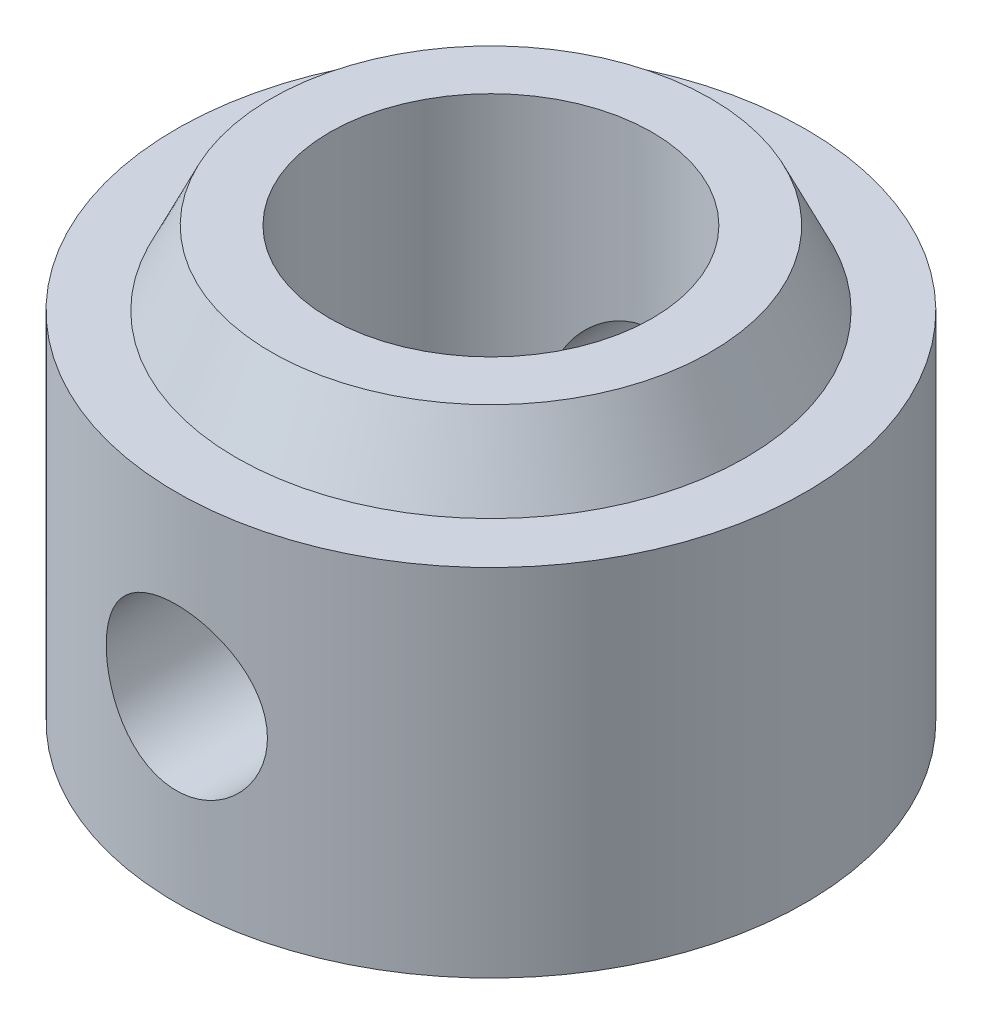
ISO-10303-21;
HEADER;
FILE_DESCRIPTION(('STEP AP214'),'2;1');
FILE_NAME('part.step','',(''),(''),'','','');
FILE_SCHEMA(('AUTOMOTIVE_DESIGN { 1 0 10303 214 1 1 1 1 }'));
ENDSEC;
DATA;
#1=APPLICATION_CONTEXT('core data for automotive mechanical design processes');
#2=APPLICATION_PROTOCOL_DEFINITION('international standard','automotive_design',2000,#1);
#3=PRODUCT_CONTEXT('',#1,'mechanical');
#4=PRODUCT('Part','Part','',(#3));
#5=PRODUCT_RELATED_PRODUCT_CATEGORY('part','',(#4));
#6=PRODUCT_DEFINITION_FORMATION('','',#4);
#7=PRODUCT_DEFINITION_CONTEXT('part definition',#1,'design');
#8=PRODUCT_DEFINITION('design','',#6,#7);
#9=PRODUCT_DEFINITION_SHAPE('','',#8);
#10=(LENGTH_UNIT() NAMED_UNIT(*) SI_UNIT(.MILLI.,.METRE.));
#11=(NAMED_UNIT(*) PLANE_ANGLE_UNIT() SI_UNIT($,.RADIAN.));
#12=(NAMED_UNIT(*) SI_UNIT($,.STERADIAN.) SOLID_ANGLE_UNIT());
#13=UNCERTAINTY_MEASURE_WITH_UNIT(LENGTH_MEASURE(1.E-05),#10,'distance_accuracy_value','');
#14=(GEOMETRIC_REPRESENTATION_CONTEXT(3) GLOBAL_UNCERTAINTY_ASSIGNED_CONTEXT((#13)) GLOBAL_UNIT_ASSIGNED_CONTEXT((#10,
#11,#12)) REPRESENTATION_CONTEXT('',''));
#15=CARTESIAN_POINT('',(0.,0.,0.));
#16=DIRECTION('',(0.,0.,1.));
#17=DIRECTION('',(1.,0.,0.));
#18=AXIS2_PLACEMENT_3D('',#15,#16,#17);
#19=CARTESIAN_POINT('',(2.794,5.461,0.));
#20=DIRECTION('',(0.,1.,0.));
#21=DIRECTION('',(0.,0.,1.));
#22=AXIS2_PLACEMENT_3D('',#19,#20,#21);
#23=PLANE('',#22);
#24=CARTESIAN_POINT('',(0.,5.461,0.));
#25=DIRECTION('',(0.,-1.,0.));
#26=DIRECTION('',(0.,0.,-1.));
#27=AXIS2_PLACEMENT_3D('',#24,#25,#26);
#28=CIRCLE('',#27,2.05);
#29=CARTESIAN_POINT('',(0.,5.461,-2.05));
#30=VERTEX_POINT('',#29);
#31=EDGE_CURVE('E51',#30,#30,#28,.T.);
#32=ORIENTED_EDGE('',*,*,#31,.T.);
#33=EDGE_LOOP('',(#32));
#34=FACE_BOUND('',#33,.T.);
#35=CARTESIAN_POINT('',(0.,5.461,0.));
#36=DIRECTION('',(0.,-1.,0.));
#37=DIRECTION('',(0.,0.,-1.));
#38=AXIS2_PLACEMENT_3D('',#35,#36,#37);
#39=CIRCLE('',#38,2.794);
#40=CARTESIAN_POINT('',(0.,5.461,-2.794));
#41=VERTEX_POINT('',#40);
#42=EDGE_CURVE('E110',#41,#41,#39,.T.);
#43=ORIENTED_EDGE('',*,*,#42,.F.);
#44=EDGE_LOOP('',(#43));
#45=FACE_BOUND('',#44,.T.);
#46=ADVANCED_FACE('F36',(#34,#45),#23,.T.);
#47=CARTESIAN_POINT('',(0.,0.,0.));
#48=DIRECTION('',(0.,-1.,0.));
#49=DIRECTION('',(0.,0.,-1.));
#50=AXIS2_PLACEMENT_3D('',#47,#48,#49);
#51=CYLINDRICAL_SURFACE('',#50,2.05);
#52=CARTESIAN_POINT('',(0.,3.28559999999999,-2.05));
#53=CARTESIAN_POINT('',(-0.0538862620268108,3.2855966151225,-2.04999706239255));
#54=CARTESIAN_POINT('',(-0.107836764690483,3.28132567505028,-2.04785253295006));
#55=CARTESIAN_POINT('',(-0.214143241150135,3.26443079765055,-2.03948509938331));
#56=CARTESIAN_POINT('',(-0.26649598888134,3.2517909971774,-2.03325445024708));
#57=CARTESIAN_POINT('',(-0.367906883502587,3.21877634616778,-2.01736686388394));
#58=CARTESIAN_POINT('',(-0.416976973012657,3.19843155614578,-2.00772325156958));
#59=CARTESIAN_POINT('',(-0.510934432226727,3.15074011310093,-1.98589420928673));
#60=CARTESIAN_POINT('',(-0.555822131339798,3.12339401214492,-1.97370897974368));
#61=CARTESIAN_POINT('',(-0.643195513205963,3.06059481927756,-1.94705164714508));
#62=CARTESIAN_POINT('',(-0.685371591400161,3.02475135877936,-1.93248579105724));
#63=CARTESIAN_POINT('',(-0.763398930988648,2.94681548377178,-1.90301469502913));
#64=CARTESIAN_POINT('',(-0.799245372684431,2.90471835193324,-1.88810920614261));
#65=CARTESIAN_POINT('',(-0.86638330046153,2.81155456673853,-1.85831424977281));
#66=CARTESIAN_POINT('',(-0.897105968940423,2.76004549919543,-1.84351566644385));
#67=CARTESIAN_POINT('',(-0.949322432562957,2.65177348061413,-1.81718128241629));
#68=CARTESIAN_POINT('',(-0.970822820340486,2.59501431805918,-1.80564315297165));
#69=CARTESIAN_POINT('',(-1.0025857532433,2.48131826694253,-1.78819313713754));
#70=CARTESIAN_POINT('',(-1.01344400350745,2.42459543663092,-1.78198578373307));
#71=CARTESIAN_POINT('',(-1.02543766814156,2.30982169127604,-1.77511437197241));
#72=CARTESIAN_POINT('',(-1.02658269058239,2.25177214560707,-1.77444483576871));
#73=CARTESIAN_POINT('',(-1.01955446935159,2.14345682507675,-1.7784870351368));
#74=CARTESIAN_POINT('',(-1.01247917352524,2.09309036799637,-1.78256482753564));
#75=CARTESIAN_POINT('',(-0.991113345283349,1.99438504289263,-1.79453134452197));
#76=CARTESIAN_POINT('',(-0.976820514495086,1.94604682606205,-1.80242128302571));
#77=CARTESIAN_POINT('',(-0.941165024895647,1.8513901391202,-1.8212966332306));
#78=CARTESIAN_POINT('',(-0.919645443793888,1.80514494124457,-1.83234986680599));
#79=CARTESIAN_POINT('',(-0.870267729859696,1.71669985009524,-1.85630989388439));
#80=CARTESIAN_POINT('',(-0.842406749907772,1.67450178600991,-1.86921751899696));
#81=CARTESIAN_POINT('',(-0.777017706285602,1.5897157159382,-1.89740986850868));
#82=CARTESIAN_POINT('',(-0.738711819828507,1.54775670458444,-1.91278847992665));
#83=CARTESIAN_POINT('',(-0.655544468209902,1.47059619594433,-1.94286313882918));
#84=CARTESIAN_POINT('',(-0.610679887988637,1.43539792816527,-1.95755885757771));
#85=CARTESIAN_POINT('',(-0.51302941847764,1.37122219744453,-1.98544536965038));
#86=CARTESIAN_POINT('',(-0.459972431389389,1.34260951574312,-1.99853458766058));
#87=CARTESIAN_POINT('',(-0.348977870876013,1.29495054523092,-2.02086828149273));
#88=CARTESIAN_POINT('',(-0.291044215671905,1.27589666035946,-2.03011580917141));
#89=CARTESIAN_POINT('',(-0.177085653952216,1.24946271119041,-2.04307442084972));
#90=CARTESIAN_POINT('',(-0.12130006881203,1.24124648335956,-2.04718061758844));
#91=CARTESIAN_POINT('',(-0.00899908994808621,1.23409865058715,-2.05074838795579));
#92=CARTESIAN_POINT('',(0.0475159453666497,1.23516264721954,-2.05021216189345));
#93=CARTESIAN_POINT('',(0.155013796285644,1.24606185562923,-2.04478472059777));
#94=CARTESIAN_POINT('',(0.206085893251203,1.25521084604829,-2.04023426830394));
#95=CARTESIAN_POINT('',(0.305867064609464,1.28094402369247,-2.02767725597689));
#96=CARTESIAN_POINT('',(0.354575877833271,1.2975290306147,-2.01967031492691));
#97=CARTESIAN_POINT('',(0.449860823660905,1.33809842809401,-2.00063857699011));
#98=CARTESIAN_POINT('',(0.496336156931306,1.36228082636974,-1.98953403814188));
#99=CARTESIAN_POINT('',(0.584722895741391,1.4171352240372,-1.96537573675037));
#100=CARTESIAN_POINT('',(0.626632345519661,1.44780998795827,-1.9523211445493));
#101=CARTESIAN_POINT('',(0.709061881522916,1.5182544359662,-1.92400926870901));
#102=CARTESIAN_POINT('',(0.749041379770251,1.55862144016491,-1.90866156969653));
#103=CARTESIAN_POINT('',(0.821902729141066,1.64552328005104,-1.87843951393971));
#104=CARTESIAN_POINT('',(0.854779670333107,1.69206234678679,-1.86356549066065));
#105=CARTESIAN_POINT('',(0.914000612360133,1.79283474555533,-1.8352747203172));
#106=CARTESIAN_POINT('',(0.939951133275598,1.84733154786382,-1.82196342905059));
#107=CARTESIAN_POINT('',(0.982034896664141,1.96079781938484,-1.7996342417733));
#108=CARTESIAN_POINT('',(0.998180788784752,2.01976141466372,-1.79061081696634));
#109=CARTESIAN_POINT('',(1.01870822963591,2.13443297843299,-1.77900538533884));
#110=CARTESIAN_POINT('',(1.02407032131088,2.18991010976476,-1.77588818047004));
#111=CARTESIAN_POINT('',(1.0257063832403,2.30103324385,-1.7749448851233));
#112=CARTESIAN_POINT('',(1.02198429279,2.35667916295792,-1.77711650118242));
#113=CARTESIAN_POINT('',(1.00647427873206,2.46097058907032,-1.78593808601276));
#114=CARTESIAN_POINT('',(0.995488522201361,2.50977798189801,-1.79214171844454));
#115=CARTESIAN_POINT('',(0.966754742180253,2.60480332241032,-1.80780291592616));
#116=CARTESIAN_POINT('',(0.949004543438797,2.65102043164427,-1.81726152758918));
#117=CARTESIAN_POINT('',(0.905911138933192,2.74299047226127,-1.83914243623642));
#118=CARTESIAN_POINT('',(0.880137916261861,2.78850359937544,-1.85172115456096));
#119=CARTESIAN_POINT('',(0.822204745927542,2.8748563995851,-1.87816214925455));
#120=CARTESIAN_POINT('',(0.790041475519606,2.91569362378145,-1.89202509139385));
#121=CARTESIAN_POINT('',(0.715658409831249,2.99669553191655,-1.92148881238296));
#122=CARTESIAN_POINT('',(0.672691533585417,3.03617557992097,-1.93709607894256));
#123=CARTESIAN_POINT('',(0.580308676375779,3.10751955800922,-1.96674696061465));
#124=CARTESIAN_POINT('',(0.530889241338197,3.13937938291194,-1.98078973073241));
#125=CARTESIAN_POINT('',(0.426329886740438,3.19461727183125,-2.00590459824731));
#126=CARTESIAN_POINT('',(0.371151991532973,3.21793377364672,-2.01695498976982));
#127=CARTESIAN_POINT('',(0.25701065382654,3.25465337211692,-2.03463874897552));
#128=CARTESIAN_POINT('',(0.198058494613739,3.26808464300031,-2.04128466457255));
#129=CARTESIAN_POINT('',(0.115416995145464,3.27934484635274,-2.04687848457405));
#130=CARTESIAN_POINT('',(0.0924159264254825,3.2816872068852,-2.04804599472682));
#131=CARTESIAN_POINT('',(0.0462805251023348,3.28481553215472,-2.04960739402311));
#132=CARTESIAN_POINT('',(0.023146188838565,3.28560145393297,-2.05000126181357));
#133=CARTESIAN_POINT('',(0.,3.28559999999999,-2.05));
#134=B_SPLINE_CURVE_WITH_KNOTS('',3,(#52,#53,#54,#55,#56,#57,#58,#59,#60,#61,#62,#63,#64,#65,
#66,#67,#68,#69,#70,#71,#72,#73,#74,#75,#76,#77,#78,#79,#80,#81,#82,#83,#84,#85,#86,#87,#88,#89,
#90,#91,#92,#93,#94,#95,#96,#97,#98,#99,#100,#101,#102,#103,#104,#105,#106,#107,#108,#109,#110,
#111,#112,#113,#114,#115,#116,#117,#118,#119,#120,#121,#122,#123,#124,#125,#126,#127,#128,#129,
#130,#131,#132,#133),.UNSPECIFIED.,.T.,.F.,(4,2,2,2,2,2,2,2,2,2,2,2,2,2,2,2,2,2,2,2,2,2,2,2,2,2,
2,2,2,2,2,2,2,2,2,2,2,2,2,2,4),(0.,0.161564863855799,0.323436853451926,0.484683709379603,
0.645917854596104,0.816906302686037,0.988024393595381,1.17241269591521,1.35666896595737,
1.52989462443734,1.70294891262245,1.85530855219552,2.00771674023819,2.16367496172698,
2.31970334291726,2.49551564867224,2.67141172963652,2.855475977698,3.03939372335085,
3.20807872733127,3.37668378624261,3.53222079168773,3.68777494671702,3.84777677428594,
4.00784687017045,4.18363600910527,4.35954628330815,4.54397549213663,4.72816624739294,
4.8946754018583,5.06111236356502,5.21169378500284,5.36232367003266,5.52307368195001,
5.68390750167428,5.86428373821307,6.04475692960983,6.22650614004494,6.40773531340549,
6.47713162141136,6.54652984477713),.UNSPECIFIED.);
#135=CARTESIAN_POINT('',(0.,3.28559999999999,-2.05));
#136=VERTEX_POINT('',#135);
#137=EDGE_CURVE('E82',#136,#136,#134,.T.);
#138=ORIENTED_EDGE('',*,*,#137,.F.);
#139=EDGE_LOOP('',(#138));
#140=FACE_BOUND('',#139,.T.);
#141=CARTESIAN_POINT('',(1.02499999999999,2.2606,1.7753520777581));
#142=CARTESIAN_POINT('',(1.02499627215139,2.20718949659987,1.77535673096671));
#143=CARTESIAN_POINT('',(1.02079747000154,2.15371155318683,1.77779896217451));
#144=CARTESIAN_POINT('',(1.0042162901455,2.04839705370592,1.78721425613354));
#145=CARTESIAN_POINT('',(0.991816716168026,1.99656418708051,1.79419683906949));
#146=CARTESIAN_POINT('',(0.9595024474173,1.89626204404746,1.81168080270534));
#147=CARTESIAN_POINT('',(0.939627701306067,1.84777648121458,1.82216344560084));
#148=CARTESIAN_POINT('',(0.893049213510774,1.75484019295337,1.8454373143728));
#149=CARTESIAN_POINT('',(0.866345102386661,1.71038968598098,1.85822866512967));
#150=CARTESIAN_POINT('',(0.804283204044144,1.62273662822856,1.88596790783878));
#151=CARTESIAN_POINT('',(0.768393337047358,1.57993938593462,1.90100665228903));
#152=CARTESIAN_POINT('',(0.690085152804824,1.50065640188313,1.93081282355349));
#153=CARTESIAN_POINT('',(0.647663598926844,1.4641738083519,1.94558011177031));
#154=CARTESIAN_POINT('',(0.554001802499904,1.39614867007365,1.97437013876773));
#155=CARTESIAN_POINT('',(0.502359868737884,1.36510488794399,1.98827559078627));
#156=CARTESIAN_POINT('',(0.393760952264487,1.3123306254231,2.01259525002017));
#157=CARTESIAN_POINT('',(0.336807351591605,1.29059426745941,2.02301165963335));
#158=CARTESIAN_POINT('',(0.223496067524124,1.25865772216638,2.03852472775343));
#159=CARTESIAN_POINT('',(0.167384335251035,1.24774673548559,2.04394717226414));
#160=CARTESIAN_POINT('',(0.0538848944152927,1.23542972835809,2.05007773442219));
#161=CARTESIAN_POINT('',(-0.00350202098983318,1.2340179567844,2.05078870454205));
#162=CARTESIAN_POINT('',(-0.112578337534344,1.24046534081962,2.04757056464361));
#163=CARTESIAN_POINT('',(-0.164329229156211,1.24752896590926,2.04403958289464));
#164=CARTESIAN_POINT('',(-0.26579661621628,1.26930286500228,2.03333601391241));
#165=CARTESIAN_POINT('',(-0.315512959121273,1.28401371120064,2.02616315418054));
#166=CARTESIAN_POINT('',(-0.412367126358791,1.32075963024207,2.00870872869846));
#167=CARTESIAN_POINT('',(-0.459459759103056,1.34289322100138,1.99838552567429));
#168=CARTESIAN_POINT('',(-0.54937622155116,1.39372000160654,1.97556087136354));
#169=CARTESIAN_POINT('',(-0.59219851505961,1.42241553988492,1.96305864061421));
#170=CARTESIAN_POINT('',(-0.676678002420647,1.48866773532135,1.9356550425921));
#171=CARTESIAN_POINT('',(-0.717842426905091,1.52680560403417,1.9206386039813));
#172=CARTESIAN_POINT('',(-0.793456979555221,1.60930446805344,1.89065699101482));
#173=CARTESIAN_POINT('',(-0.827901941863582,1.65367020658092,1.8756918647227));
#174=CARTESIAN_POINT('',(-0.891242968008262,1.75081439723469,1.84647759994797));
#175=CARTESIAN_POINT('',(-0.919647747852497,1.80394817363057,1.83233427990476));
#176=CARTESIAN_POINT('',(-0.966902090826257,1.91511111314298,1.80784836535541));
#177=CARTESIAN_POINT('',(-0.985761624666156,1.973135093843,1.79750180797219));
#178=CARTESIAN_POINT('',(-1.01185971630066,2.08759487406486,1.78293251712461));
#179=CARTESIAN_POINT('',(-1.01990075017297,2.14379214701964,1.77828947244709));
#180=CARTESIAN_POINT('',(-1.02655487027671,2.25691137505446,1.7744586734565));
#181=CARTESIAN_POINT('',(-1.02517461624789,2.31383278984778,1.77526706561545));
#182=CARTESIAN_POINT('',(-1.01376194442756,2.4201452665432,1.781801949541));
#183=CARTESIAN_POINT('',(-1.00469251213027,2.46967893738563,1.78698077194321));
#184=CARTESIAN_POINT('',(-0.979588691748245,2.56642698092773,1.80086372090125));
#185=CARTESIAN_POINT('',(-0.963552048089197,2.61364059701527,1.8095689890516));
#186=CARTESIAN_POINT('',(-0.924188778320001,2.70689661417526,1.82999627631648));
#187=CARTESIAN_POINT('',(-0.900558915285034,2.75278349227489,1.8418393432414));
#188=CARTESIAN_POINT('',(-0.846944240616192,2.84020600332747,1.86710022484681));
#189=CARTESIAN_POINT('',(-0.816956164440514,2.88173938460111,1.88051884689027));
#190=CARTESIAN_POINT('',(-0.747058096378818,2.96475323671163,1.90945198417745));
#191=CARTESIAN_POINT('',(-0.706373904122834,3.0055670794856,1.92501747733147));
#192=CARTESIAN_POINT('',(-0.618489607783239,3.07999754394343,1.9550259085234));
#193=CARTESIAN_POINT('',(-0.571287311521724,3.1136117344863,1.96946846632902));
#194=CARTESIAN_POINT('',(-0.46999874662272,3.17343806909885,1.99609895733231));
#195=CARTESIAN_POINT('',(-0.41576367501346,3.19943144616618,2.0082173271383));
#196=CARTESIAN_POINT('',(-0.302910423757104,3.24166635145382,2.02830438833284));
#197=CARTESIAN_POINT('',(-0.244296143926976,3.25791644265046,2.03627672268282));
#198=CARTESIAN_POINT('',(-0.130154174388674,3.27880277827902,2.0465919588643));
#199=CARTESIAN_POINT('',(-0.0748367299467154,3.28436782277301,2.04938426105896));
#200=CARTESIAN_POINT('',(0.0360041355999858,3.28646434709075,2.05043183634509));
#201=CARTESIAN_POINT('',(0.0915274778024655,3.28299898923665,2.04868869768562));
#202=CARTESIAN_POINT('',(0.197351442125077,3.26774818303448,2.04112318058871));
#203=CARTESIAN_POINT('',(0.247755125756546,3.25652602951088,2.0355771703469));
#204=CARTESIAN_POINT('',(0.345882100988208,3.22683982571445,2.02121896005009));
#205=CARTESIAN_POINT('',(0.393605007079396,3.2083747369042,2.01240629161116));
#206=CARTESIAN_POINT('',(0.487308991401006,3.16390477152987,1.99184079016823));
#207=CARTESIAN_POINT('',(0.533128271267546,3.13761119371196,1.97997832628769));
#208=CARTESIAN_POINT('',(0.619894007859373,3.07859312086947,1.95455336470372));
#209=CARTESIAN_POINT('',(0.660838212600278,3.04586567215643,1.9409900872232));
#210=CARTESIAN_POINT('',(0.740986854260811,2.97113293250172,1.91191825482293));
#211=CARTESIAN_POINT('',(0.77961262665275,2.92852845033587,1.8963504398699));
#212=CARTESIAN_POINT('',(0.849379869579538,2.83721301084198,1.86614653066924));
#213=CARTESIAN_POINT('',(0.880514718760306,2.78849670861062,1.85151126905912));
#214=CARTESIAN_POINT('',(0.935241856780291,2.68429743725451,1.82449595437539));
#215=CARTESIAN_POINT('',(0.958564692609957,2.62864928059304,1.81220178612677));
#216=CARTESIAN_POINT('',(0.995150677244065,2.51343428555172,1.79237810236561));
#217=CARTESIAN_POINT('',(1.00844747095472,2.45388128886449,1.78483266551395));
#218=CARTESIAN_POINT('',(1.01922618306102,2.3714995104567,1.77867504416836));
#219=CARTESIAN_POINT('',(1.02138800758794,2.34939790824217,1.77743332230281));
#220=CARTESIAN_POINT('',(1.0242757402172,2.3050681073007,1.77577084284944));
#221=CARTESIAN_POINT('',(1.02500155225986,2.28283990020448,1.77535014018238));
#222=CARTESIAN_POINT('',(1.02499999999999,2.2606,1.7753520777581));
#223=B_SPLINE_CURVE_WITH_KNOTS('',3,(#141,#142,#143,#144,#145,#146,#147,#148,#149,#150,#151,
#152,#153,#154,#155,#156,#157,#158,#159,#160,#161,#162,#163,#164,#165,#166,#167,#168,#169,#170,
#171,#172,#173,#174,#175,#176,#177,#178,#179,#180,#181,#182,#183,#184,#185,#186,#187,#188,#189,
#190,#191,#192,#193,#194,#195,#196,#197,#198,#199,#200,#201,#202,#203,#204,#205,#206,#207,#208,
#209,#210,#211,#212,#213,#214,#215,#216,#217,#218,#219,#220,#221,#222),.UNSPECIFIED.,.T.,.F.,(4,
2,2,2,2,2,2,2,2,2,2,2,2,2,2,2,2,2,2,2,2,2,2,2,2,2,2,2,2,2,2,2,2,2,2,2,2,2,2,2,4),(0.,
0.160137925659582,0.320612715145423,0.480241810816855,0.639879543581275,0.812683870310685,
0.985574103614796,1.17011839544732,1.35454597637987,1.52585072092133,1.6970517427819,
1.85336499921651,2.0096899533039,2.16817773099424,2.32672231834027,2.50025371243311,
2.67391799452065,2.85861062772683,3.04310993566995,3.21298848125565,3.3827469551808,
3.53393538009624,3.68517278746962,3.84341478816237,4.00173823375546,4.18001912170126,
4.35836011602654,4.54140785948287,4.72429449303988,4.89040077149221,5.05644888963817,
5.21155535493276,5.3666840684981,5.52844769487455,5.69028575853233,5.86822997896315,
6.04633091416279,6.23006017764566,6.41317011327825,6.47984638564938,6.54652711806899),.UNSPECIFIED.);
#224=CARTESIAN_POINT('',(1.02499999999999,2.2606,1.7753520777581));
#225=VERTEX_POINT('',#224);
#226=EDGE_CURVE('E77',#225,#225,#223,.T.);
#227=ORIENTED_EDGE('',*,*,#226,.F.);
#228=EDGE_LOOP('',(#227));
#229=FACE_BOUND('',#228,.T.);
#230=CARTESIAN_POINT('',(0.,0.,0.));
#231=DIRECTION('',(0.,-1.,0.));
#232=DIRECTION('',(0.,0.,-1.));
#233=AXIS2_PLACEMENT_3D('',#230,#231,#232);
#234=CIRCLE('',#233,2.05);
#235=CARTESIAN_POINT('',(0.,0.,-2.05));
#236=VERTEX_POINT('',#235);
#237=EDGE_CURVE('E55',#236,#236,#234,.T.);
#238=ORIENTED_EDGE('',*,*,#237,.T.);
#239=EDGE_LOOP('',(#238));
#240=FACE_BOUND('',#239,.T.);
#241=ORIENTED_EDGE('',*,*,#31,.F.);
#242=EDGE_LOOP('',(#241));
#243=FACE_BOUND('',#242,.T.);
#244=ADVANCED_FACE('F87',(#140,#229,#240,#243),#51,.F.);
#245=CARTESIAN_POINT('',(2.05,0.,0.));
#246=DIRECTION('',(0.,-1.,0.));
#247=DIRECTION('',(0.,0.,-1.));
#248=AXIS2_PLACEMENT_3D('',#245,#246,#247);
#249=PLANE('',#248);
#250=CARTESIAN_POINT('',(0.,0.,0.));
#251=DIRECTION('',(0.,-1.,0.));
#252=DIRECTION('',(0.,0.,-1.));
#253=AXIS2_PLACEMENT_3D('',#250,#251,#252);
#254=CIRCLE('',#253,4.0005);
#255=CARTESIAN_POINT('',(0.,0.,-4.0005));
#256=VERTEX_POINT('',#255);
#257=EDGE_CURVE('E120',#256,#256,#254,.T.);
#258=ORIENTED_EDGE('',*,*,#257,.T.);
#259=EDGE_LOOP('',(#258));
#260=FACE_BOUND('',#259,.T.);
#261=ORIENTED_EDGE('',*,*,#237,.F.);
#262=EDGE_LOOP('',(#261));
#263=FACE_BOUND('',#262,.T.);
#264=ADVANCED_FACE('F90',(#260,#263),#249,.T.);
#265=CARTESIAN_POINT('',(0.,0.,0.));
#266=DIRECTION('',(0.,-1.,0.));
#267=DIRECTION('',(0.,0.,-1.));
#268=AXIS2_PLACEMENT_3D('',#265,#266,#267);
#269=CYLINDRICAL_SURFACE('',#268,4.0005);
#270=CARTESIAN_POINT('',(0.,3.28559999999999,-4.0005));
#271=CARTESIAN_POINT('',(0.0565856520355311,3.28559849777205,-4.00049907665074));
#272=CARTESIAN_POINT('',(0.113187824681379,3.28089849548102,-3.99928751601397));
#273=CARTESIAN_POINT('',(0.224766894228792,3.26225269364964,-3.99457185317012));
#274=CARTESIAN_POINT('',(0.27974290452061,3.24830194409511,-3.99106652359556));
#275=CARTESIAN_POINT('',(0.38644249190922,3.21163399004599,-3.98215102125961));
#276=CARTESIAN_POINT('',(0.438169989596085,3.18892759863071,-3.97674319876614));
#277=CARTESIAN_POINT('',(0.537082037222003,3.13543170778277,-3.96459702091124));
#278=CARTESIAN_POINT('',(0.584266378294337,3.10464183696316,-3.95785860442061));
#279=CARTESIAN_POINT('',(0.673769466813125,3.03515230170528,-3.94361895772714));
#280=CARTESIAN_POINT('',(0.715976368500867,2.99631108142151,-3.93610548786994));
#281=CARTESIAN_POINT('',(0.793353940988788,2.91212430487071,-3.92124285736807));
#282=CARTESIAN_POINT('',(0.828523777728434,2.86677797868534,-3.91389371629186));
#283=CARTESIAN_POINT('',(0.891361949953948,2.76999087243635,-3.9000677913987));
#284=CARTESIAN_POINT('',(0.918903871040848,2.71846560215945,-3.89360651146785));
#285=CARTESIAN_POINT('',(0.964890978467045,2.61132388915671,-3.88246691727216));
#286=CARTESIAN_POINT('',(0.983337700029715,2.55570813870561,-3.87778830213288));
#287=CARTESIAN_POINT('',(1.01022669536665,2.44319732502387,-3.87086977569368));
#288=CARTESIAN_POINT('',(1.01887069272048,2.38635356197169,-3.86858077192817));
#289=CARTESIAN_POINT('',(1.02653741731668,2.27198018220795,-3.86655378933475));
#290=CARTESIAN_POINT('',(1.02556179410691,2.21445068477419,-3.86681537313852));
#291=CARTESIAN_POINT('',(1.01417762540951,2.10189526053198,-3.86981595078273));
#292=CARTESIAN_POINT('',(1.00401080428216,2.04684292640748,-3.87249145599117));
#293=CARTESIAN_POINT('',(0.97491900866929,1.93925260200016,-3.87991706018316));
#294=CARTESIAN_POINT('',(0.95599338232822,1.88671479917718,-3.88466731357399));
#295=CARTESIAN_POINT('',(0.909718532370253,1.78500335565479,-3.89576455424812));
#296=CARTESIAN_POINT('',(0.882282677942408,1.73587098107854,-3.90212783380235));
#297=CARTESIAN_POINT('',(0.819826705209562,1.64282140484394,-3.9157251097992));
#298=CARTESIAN_POINT('',(0.784805198572286,1.59890516012708,-3.92295926552248));
#299=CARTESIAN_POINT('',(0.706925856302228,1.51615073489325,-3.93774939369166));
#300=CARTESIAN_POINT('',(0.663864395745712,1.47750449410637,-3.9453085088336));
#301=CARTESIAN_POINT('',(0.571780475697047,1.40794437822194,-3.9597014691485));
#302=CARTESIAN_POINT('',(0.522757815690972,1.37703076332991,-3.96653528991061));
#303=CARTESIAN_POINT('',(0.419860664920584,1.32373784814417,-3.97874452966118));
#304=CARTESIAN_POINT('',(0.365968649407784,1.30139102489297,-3.984114376888));
#305=CARTESIAN_POINT('',(0.255024321130355,1.26612841493599,-3.992750215979));
#306=CARTESIAN_POINT('',(0.19797264675609,1.25321073055341,-3.99601663115725));
#307=CARTESIAN_POINT('',(0.0839684367910663,1.23746922637122,-4.00001442218531));
#308=CARTESIAN_POINT('',(0.0270542170308757,1.23438418185035,-4.00081138779299));
#309=CARTESIAN_POINT('',(-0.0864776689434303,1.23767725439246,-3.99996794009198));
#310=CARTESIAN_POINT('',(-0.143095362779339,1.24405447371293,-3.99832775801029));
#311=CARTESIAN_POINT('',(-0.253510277163968,1.26587609532791,-3.99283646479678));
#312=CARTESIAN_POINT('',(-0.307337795550936,1.2811768185167,-3.98902040909669));
#313=CARTESIAN_POINT('',(-0.411658439333348,1.32024600315928,-3.97960841995657));
#314=CARTESIAN_POINT('',(-0.4621512178361,1.34401534391239,-3.97401230169854));
#315=CARTESIAN_POINT('',(-0.559399526306897,1.39984531483197,-3.96150507079384));
#316=CARTESIAN_POINT('',(-0.606068998524409,1.43205071910153,-3.95457161773689));
#317=CARTESIAN_POINT('',(-0.693433574592071,1.50365470100679,-3.94019209400238));
#318=CARTESIAN_POINT('',(-0.734127590301489,1.54305458584604,-3.93274593032109));
#319=CARTESIAN_POINT('',(-0.809471560504464,1.62914439189758,-3.91794217807143));
#320=CARTESIAN_POINT('',(-0.843937860780835,1.67599657610982,-3.91059186780342));
#321=CARTESIAN_POINT('',(-0.904520337582659,1.77497264100638,-3.89702588219254));
#322=CARTESIAN_POINT('',(-0.930636879119626,1.82709629111627,-3.89081015725614));
#323=CARTESIAN_POINT('',(-0.973582573928539,1.93486171479209,-3.88028688582065));
#324=CARTESIAN_POINT('',(-0.990466536916038,1.99048049135351,-3.87596810879017));
#325=CARTESIAN_POINT('',(-1.01460737787969,2.10389566089835,-3.86971969862209));
#326=CARTESIAN_POINT('',(-1.02186648899609,2.16169154555165,-3.86778951129527));
#327=CARTESIAN_POINT('',(-1.02643050385148,2.27594737493201,-3.86658056547745));
#328=CARTESIAN_POINT('',(-1.0240295255589,2.3323949253605,-3.86722346187657));
#329=CARTESIAN_POINT('',(-1.01001799086857,2.44405142804303,-3.87090626775807));
#330=CARTESIAN_POINT('',(-0.998407637939617,2.49926040763393,-3.87394612428282));
#331=CARTESIAN_POINT('',(-0.96647125753609,2.6065343658981,-3.88203556582922));
#332=CARTESIAN_POINT('',(-0.946203018290877,2.65861762440886,-3.88707180992111));
#333=CARTESIAN_POINT('',(-0.897571546702513,2.75868245583385,-3.89858785099527));
#334=CARTESIAN_POINT('',(-0.86920713640441,2.80666343056391,-3.90506785800816));
#335=CARTESIAN_POINT('',(-0.804277673936519,2.89857663791603,-3.91896244761567));
#336=CARTESIAN_POINT('',(-0.767509768144362,2.94236246401581,-3.92639772474921));
#337=CARTESIAN_POINT('',(-0.687208852605598,3.02323835803092,-3.9412445353546));
#338=CARTESIAN_POINT('',(-0.643674225670723,3.06032682074139,-3.94865606271717));
#339=CARTESIAN_POINT('',(-0.55006222236862,3.12745485883959,-3.96279102374742));
#340=CARTESIAN_POINT('',(-0.499874845350383,3.15734467711237,-3.96949842814516));
#341=CARTESIAN_POINT('',(-0.395019205586422,3.20821554889441,-3.98129811383972));
#342=CARTESIAN_POINT('',(-0.34035406329836,3.22920274448214,-3.98639150805527));
#343=CARTESIAN_POINT('',(-0.238186536461553,3.25869473890942,-3.99367058697017));
#344=CARTESIAN_POINT('',(-0.191154498557696,3.26876181802624,-3.99621363758003));
#345=CARTESIAN_POINT('',(-0.0960855549946674,3.28221480803541,-3.99962866650269));
#346=CARTESIAN_POINT('',(-0.0480487333964109,3.28560127559102,-4.00050078404615));
#347=CARTESIAN_POINT('',(0.,3.28559999999999,-4.0005));
#348=B_SPLINE_CURVE_WITH_KNOTS('',3,(#270,#271,#272,#273,#274,#275,#276,#277,#278,#279,#280,
#281,#282,#283,#284,#285,#286,#287,#288,#289,#290,#291,#292,#293,#294,#295,#296,#297,#298,#299,
#300,#301,#302,#303,#304,#305,#306,#307,#308,#309,#310,#311,#312,#313,#314,#315,#316,#317,#318,
#319,#320,#321,#322,#323,#324,#325,#326,#327,#328,#329,#330,#331,#332,#333,#334,#335,#336,#337,
#338,#339,#340,#341,#342,#343,#344,#345,#346,#347),.UNSPECIFIED.,.T.,.F.,(4,2,2,2,2,2,2,2,2,2,2,
2,2,2,2,2,2,2,2,2,2,2,2,2,2,2,2,2,2,2,2,2,2,2,2,2,2,2,4),(0.,0.169580829374382,
0.339252473641572,0.50871524376946,0.678185801048968,0.850936364322594,1.02370739055761,
1.19919035607852,1.3746436908191,1.54641696915123,1.71816079275437,1.88551517966282,
2.05288202357081,2.22201184145331,2.39117263980846,2.56540986708087,2.73965295670698,
2.91455022594671,3.08941228623732,3.25958828234983,3.42974813386286,3.59724102176596,
3.76475130558077,3.9353496906081,4.10597910346527,4.28102394710351,4.45606113757183,
4.63004760592823,4.80399369919943,4.9726843993393,5.1413713725877,5.30894959521507,
5.47655221212774,5.64873329866688,5.82095559845911,5.99649972742941,6.17192254760959,
6.31593119286833,6.45992783807153),.UNSPECIFIED.);
#349=CARTESIAN_POINT('',(0.,3.28559999999999,-4.0005));
#350=VERTEX_POINT('',#349);
#351=EDGE_CURVE('E10',#350,#350,#348,.T.);
#352=ORIENTED_EDGE('',*,*,#351,.F.);
#353=EDGE_LOOP('',(#352));
#354=FACE_BOUND('',#353,.T.);
#355=CARTESIAN_POINT('',(1.02499999999999,2.2606,3.86695943216373));
#356=CARTESIAN_POINT('',(1.02499847839395,2.31715127083633,3.86696048112815));
#357=CARTESIAN_POINT('',(1.02030398935772,2.37371910198535,3.86821351283285));
#358=CARTESIAN_POINT('',(1.00168206772039,2.48522693941926,3.87307665172426));
#359=CARTESIAN_POINT('',(0.987749534848884,2.54016602897127,3.87668806094086));
#360=CARTESIAN_POINT('',(0.951134812067311,2.64678729969593,3.88583269568403));
#361=CARTESIAN_POINT('',(0.92846428458393,2.6984737156361,3.89136335864456));
#362=CARTESIAN_POINT('',(0.875053008903884,2.7973161325729,3.90372011571529));
#363=CARTESIAN_POINT('',(0.844311812846381,2.84447188195351,3.91054628171023));
#364=CARTESIAN_POINT('',(0.774872858088816,2.9340038861901,3.92490152942573));
#365=CARTESIAN_POINT('',(0.736022582149426,2.97626000226275,3.93244229862389));
#366=CARTESIAN_POINT('',(0.651796614338291,3.05373351506768,3.94727589925247));
#367=CARTESIAN_POINT('',(0.606420289369123,3.08895022810859,3.95456870654295));
#368=CARTESIAN_POINT('',(0.509603578634907,3.15184024855808,3.96821439809951));
#369=CARTESIAN_POINT('',(0.458083832980048,3.17939501517956,3.97455188384275));
#370=CARTESIAN_POINT('',(0.350953933207238,3.22540735616127,3.98543925277415));
#371=CARTESIAN_POINT('',(0.295344415547337,3.24386634259569,3.98998941341329));
#372=CARTESIAN_POINT('',(0.182866555410419,3.27077686151273,3.99670682295692));
#373=CARTESIAN_POINT('',(0.126050004224203,3.27943253894234,3.99892261178148));
#374=CARTESIAN_POINT('',(0.011730935680085,3.28713207719075,4.00089097437555));
#375=CARTESIAN_POINT('',(-0.0457714739784088,3.28617742776476,4.00064392992388));
#376=CARTESIAN_POINT('',(-0.158412262668894,3.27482911508599,3.99775038638296));
#377=CARTESIAN_POINT('',(-0.213574506732198,3.26465588106133,3.99515992411245));
#378=CARTESIAN_POINT('',(-0.321381204386072,3.23551415085209,3.98793617876054));
#379=CARTESIAN_POINT('',(-0.374025520102875,3.21654517364737,3.98330278395627));
#380=CARTESIAN_POINT('',(-0.475876108972816,3.17017553196384,3.97242901760515));
#381=CARTESIAN_POINT('',(-0.525045527652815,3.14269749512716,3.96617398929782));
#382=CARTESIAN_POINT('',(-0.618151878718294,3.0801486756477,3.95273380734893));
#383=CARTESIAN_POINT('',(-0.662087857878604,3.04507651306947,3.94554848475828));
#384=CARTESIAN_POINT('',(-0.744795216815933,2.96715752938046,3.93078838877382));
#385=CARTESIAN_POINT('',(-0.783384505933817,2.92411821159882,3.92320835031993));
#386=CARTESIAN_POINT('',(-0.852839781965635,2.83210003915473,3.9086988938273));
#387=CARTESIAN_POINT('',(-0.883705369531312,2.78312087757136,3.90176950944173));
#388=CARTESIAN_POINT('',(-0.936961640048629,2.68024244389734,3.88932622217411));
#389=CARTESIAN_POINT('',(-0.959306427489874,2.62631841530657,3.88382003485198));
#390=CARTESIAN_POINT('',(-0.994555528428629,2.51530358463757,3.87494432977365));
#391=CARTESIAN_POINT('',(-1.00746197826102,2.45821350233393,3.87157432852219));
#392=CARTESIAN_POINT('',(-1.02316162180439,2.34418106452431,3.86745460384323));
#393=CARTESIAN_POINT('',(-1.02622492396692,2.28727838130319,3.86663491705078));
#394=CARTESIAN_POINT('',(-1.02289252521742,2.17377446940428,3.8675178287496));
#395=CARTESIAN_POINT('',(-1.01649774415822,2.11717321194838,3.86922018195804));
#396=CARTESIAN_POINT('',(-0.99466801946537,2.00689557251986,3.87488812104072));
#397=CARTESIAN_POINT('',(-0.979392198272789,1.95318544591683,3.87881383946256));
#398=CARTESIAN_POINT('',(-0.940411350866157,1.84908873526875,3.88844792618008));
#399=CARTESIAN_POINT('',(-0.916705287918982,1.79870256090013,3.89415651371869));
#400=CARTESIAN_POINT('',(-0.860977774251349,1.70154483103367,3.90685907028037));
#401=CARTESIAN_POINT('',(-0.828795885164658,1.65486850003917,3.91387698133982));
#402=CARTESIAN_POINT('',(-0.757231639726001,1.56747943346306,3.92834959597639));
#403=CARTESIAN_POINT('',(-0.717848037807719,1.52676773168631,3.93580437495984));
#404=CARTESIAN_POINT('',(-0.631755114100395,1.45135951737975,3.95054924594735));
#405=CARTESIAN_POINT('',(-0.584879691695897,1.41685041443465,3.95782977851683));
#406=CARTESIAN_POINT('',(-0.485843185130069,1.35619269297201,3.9712025408858));
#407=CARTESIAN_POINT('',(-0.433682379922384,1.33004363352774,3.97729483334903));
#408=CARTESIAN_POINT('',(-0.325919869389815,1.28708057451739,3.9875658452208));
#409=CARTESIAN_POINT('',(-0.270346767524422,1.27019832384052,3.9917585144503));
#410=CARTESIAN_POINT('',(-0.157030013038701,1.24604554495266,3.99781907696929));
#411=CARTESIAN_POINT('',(-0.0992868043537557,1.23877306177542,3.99968744309962));
#412=CARTESIAN_POINT('',(0.0149740630673891,1.23416083645734,4.00086847351959));
#413=CARTESIAN_POINT('',(0.0714800134798809,1.23654514575426,4.00025214187813));
#414=CARTESIAN_POINT('',(0.183257874548349,1.250543596616,3.99669162486758));
#415=CARTESIAN_POINT('',(0.238529825277387,1.26215743801031,3.99374751520444));
#416=CARTESIAN_POINT('',(0.34596604543745,1.29413424936469,3.98587438339588));
#417=CARTESIAN_POINT('',(0.398146758470787,1.31444507826315,3.98095720129344));
#418=CARTESIAN_POINT('',(0.498389385738841,1.36319235366074,3.96965434396504));
#419=CARTESIAN_POINT('',(0.546450757335519,1.39162986855073,3.9632684756769));
#420=CARTESIAN_POINT('',(0.638390273434719,1.45665242307099,3.94951574756745));
#421=CARTESIAN_POINT('',(0.682134027896711,1.49342314344005,3.94212837714515));
#422=CARTESIAN_POINT('',(0.762923801829469,1.57371087830743,3.92729402038276));
#423=CARTESIAN_POINT('',(0.799968098041454,1.6172296232253,3.91984701921719));
#424=CARTESIAN_POINT('',(0.867031894086367,1.71081812267651,3.90556751293444));
#425=CARTESIAN_POINT('',(0.896897297547199,1.76100080024328,3.8987501460506));
#426=CARTESIAN_POINT('',(0.947723714879953,1.86584282426492,3.88670901388025));
#427=CARTESIAN_POINT('',(0.968690971119614,1.92049900018482,3.88148413213615));
#428=CARTESIAN_POINT('',(0.998141301465995,2.0226181495902,3.8740030647801));
#429=CARTESIAN_POINT('',(1.00819075018381,2.0696086696797,3.87138211721182));
#430=CARTESIAN_POINT('',(1.02162042814593,2.16459554565842,3.86785993743997));
#431=CARTESIAN_POINT('',(1.02500129174035,2.2125918054375,3.86695854166405));
#432=CARTESIAN_POINT('',(1.02499999999999,2.2606,3.86695943216373));
#433=B_SPLINE_CURVE_WITH_KNOTS('',3,(#355,#356,#357,#358,#359,#360,#361,#362,#363,#364,#365,
#366,#367,#368,#369,#370,#371,#372,#373,#374,#375,#376,#377,#378,#379,#380,#381,#382,#383,#384,
#385,#386,#387,#388,#389,#390,#391,#392,#393,#394,#395,#396,#397,#398,#399,#400,#401,#402,#403,
#404,#405,#406,#407,#408,#409,#410,#411,#412,#413,#414,#415,#416,#417,#418,#419,#420,#421,#422,
#423,#424,#425,#426,#427,#428,#429,#430,#431,#432),.UNSPECIFIED.,.T.,.F.,(4,2,2,2,2,2,2,2,2,2,2,
2,2,2,2,2,2,2,2,2,2,2,2,2,2,2,2,2,2,2,2,2,2,2,2,2,2,2,4),(0.,0.169477427969048,
0.339048501438738,0.508394031146705,0.677748960233033,0.850634604617422,1.02353703210858,
1.19898198677352,1.37439969590265,1.54609316529554,1.7177600198497,1.88542736367478,
2.05310387794541,2.22235220350769,2.39163130918389,2.56571747811861,2.73981264619054,
2.91483272393036,3.08981317421258,3.25994900730471,3.43006829479926,3.59722957236903,
3.76441141418867,3.93501901288262,4.10565614683021,4.28080299419158,4.45594060240596,
4.62977037609765,4.8035647812245,4.97242845638943,5.1412866398542,5.30914633821954,
5.47702811475256,5.64910109725916,5.82121827823967,5.99675315782637,6.17216468904662,
6.31605322229671,6.45992806746929),.UNSPECIFIED.);
#434=CARTESIAN_POINT('',(1.02499999999999,2.2606,3.86695943216373));
#435=VERTEX_POINT('',#434);
#436=EDGE_CURVE('E47',#435,#435,#433,.T.);
#437=ORIENTED_EDGE('',*,*,#436,.F.);
#438=EDGE_LOOP('',(#437));
#439=FACE_BOUND('',#438,.T.);
#440=CARTESIAN_POINT('',(0.,4.5212,0.));
#441=DIRECTION('',(0.,-1.,0.));
#442=DIRECTION('',(0.,0.,-1.));
#443=AXIS2_PLACEMENT_3D('',#440,#441,#442);
#444=CIRCLE('',#443,4.0005);
#445=CARTESIAN_POINT('',(0.,4.5212,-4.0005));
#446=VERTEX_POINT('',#445);
#447=EDGE_CURVE('E114',#446,#446,#444,.T.);
#448=ORIENTED_EDGE('',*,*,#447,.T.);
#449=EDGE_LOOP('',(#448));
#450=FACE_BOUND('',#449,.T.);
#451=ORIENTED_EDGE('',*,*,#257,.F.);
#452=EDGE_LOOP('',(#451));
#453=FACE_BOUND('',#452,.T.);
#454=ADVANCED_FACE('F61',(#354,#439,#450,#453),#269,.T.);
#455=CARTESIAN_POINT('',(4.0005,4.5212,0.));
#456=DIRECTION('',(0.,1.,0.));
#457=DIRECTION('',(0.,0.,1.));
#458=AXIS2_PLACEMENT_3D('',#455,#456,#457);
#459=PLANE('',#458);
#460=CARTESIAN_POINT('',(0.,4.5212,0.));
#461=DIRECTION('',(0.,-1.,0.));
#462=DIRECTION('',(0.,0.,-1.));
#463=AXIS2_PLACEMENT_3D('',#460,#461,#462);
#464=CIRCLE('',#463,3.2385);
#465=CARTESIAN_POINT('',(0.,4.5212,-3.2385));
#466=VERTEX_POINT('',#465);
#467=EDGE_CURVE('E112',#466,#466,#464,.T.);
#468=ORIENTED_EDGE('',*,*,#467,.T.);
#469=EDGE_LOOP('',(#468));
#470=FACE_BOUND('',#469,.T.);
#471=ORIENTED_EDGE('',*,*,#447,.F.);
#472=EDGE_LOOP('',(#471));
#473=FACE_BOUND('',#472,.T.);
#474=ADVANCED_FACE('F98',(#470,#473),#459,.T.);
#475=CARTESIAN_POINT('',(0.,4.5212,0.));
#476=DIRECTION('',(0.,-1.,0.));
#477=DIRECTION('',(0.,0.,-1.));
#478=AXIS2_PLACEMENT_3D('',#475,#476,#477);
#479=CONICAL_SURFACE('',#478,3.2385,0.441793165517444);
#480=ORIENTED_EDGE('',*,*,#42,.T.);
#481=EDGE_LOOP('',(#480));
#482=FACE_BOUND('',#481,.T.);
#483=ORIENTED_EDGE('',*,*,#467,.F.);
#484=EDGE_LOOP('',(#483));
#485=FACE_BOUND('',#484,.T.);
#486=ADVANCED_FACE('F70',(#482,#485),#479,.T.);
#487=CARTESIAN_POINT('',(0.,2.2606,4.0005));
#488=DIRECTION('',(0.,0.,1.));
#489=DIRECTION('',(1.,0.,0.));
#490=AXIS2_PLACEMENT_3D('',#487,#488,#489);
#491=CYLINDRICAL_SURFACE('',#490,1.02499999999999);
#492=ORIENTED_EDGE('',*,*,#226,.T.);
#493=EDGE_LOOP('',(#492));
#494=FACE_BOUND('',#493,.T.);
#495=ORIENTED_EDGE('',*,*,#436,.T.);
#496=EDGE_LOOP('',(#495));
#497=FACE_BOUND('',#496,.T.);
#498=ADVANCED_FACE('F65',(#494,#497),#491,.F.);
#499=ORIENTED_EDGE('',*,*,#137,.T.);
#500=EDGE_LOOP('',(#499));
#501=FACE_BOUND('',#500,.T.);
#502=ORIENTED_EDGE('',*,*,#351,.T.);
#503=EDGE_LOOP('',(#502));
#504=FACE_BOUND('',#503,.T.);
#505=ADVANCED_FACE('F69',(#501,#504),#491,.F.);
#506=CLOSED_SHELL('',(#46,#244,#264,#454,#474,#486,#498,#505));
#507=MANIFOLD_SOLID_BREP('B2',#506);
#508=ADVANCED_BREP_SHAPE_REPRESENTATION('',(#18,#507),#14);
#509=SHAPE_DEFINITION_REPRESENTATION(#9,#508);
ENDSEC;
END-ISO-10303-21;
